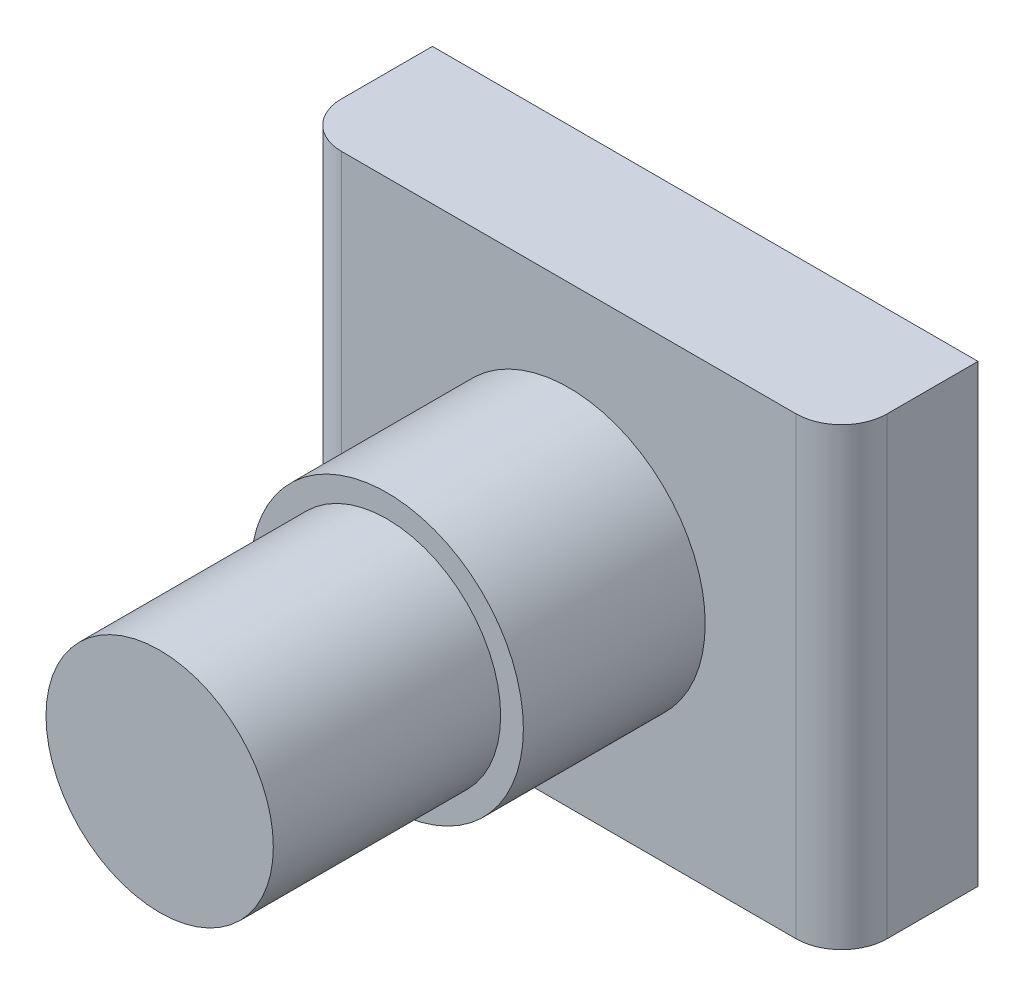
ISO-10303-21;
HEADER;
FILE_DESCRIPTION(('STEP AP214'),'2;1');
FILE_NAME('part.step','',(''),(''),'','','');
FILE_SCHEMA(('AUTOMOTIVE_DESIGN { 1 0 10303 214 1 1 1 1 }'));
ENDSEC;
DATA;
#1=APPLICATION_CONTEXT('core data for automotive mechanical design processes');
#2=APPLICATION_PROTOCOL_DEFINITION('international standard','automotive_design',2000,#1);
#3=PRODUCT_CONTEXT('',#1,'mechanical');
#4=PRODUCT('Part','Part','',(#3));
#5=PRODUCT_RELATED_PRODUCT_CATEGORY('part','',(#4));
#6=PRODUCT_DEFINITION_FORMATION('','',#4);
#7=PRODUCT_DEFINITION_CONTEXT('part definition',#1,'design');
#8=PRODUCT_DEFINITION('design','',#6,#7);
#9=PRODUCT_DEFINITION_SHAPE('','',#8);
#10=(LENGTH_UNIT() NAMED_UNIT(*) SI_UNIT(.MILLI.,.METRE.));
#11=(NAMED_UNIT(*) PLANE_ANGLE_UNIT() SI_UNIT($,.RADIAN.));
#12=(NAMED_UNIT(*) SI_UNIT($,.STERADIAN.) SOLID_ANGLE_UNIT());
#13=UNCERTAINTY_MEASURE_WITH_UNIT(LENGTH_MEASURE(1.E-05),#10,'distance_accuracy_value','');
#14=(GEOMETRIC_REPRESENTATION_CONTEXT(3) GLOBAL_UNCERTAINTY_ASSIGNED_CONTEXT((#13)) GLOBAL_UNIT_ASSIGNED_CONTEXT((#10,
#11,#12)) REPRESENTATION_CONTEXT('',''));
#15=CARTESIAN_POINT('',(0.,0.,0.));
#16=DIRECTION('',(0.,0.,1.));
#17=DIRECTION('',(1.,0.,0.));
#18=AXIS2_PLACEMENT_3D('',#15,#16,#17);
#19=CARTESIAN_POINT('',(6.,5.,3.));
#20=DIRECTION('',(-1.,0.,0.));
#21=DIRECTION('',(0.,-1.,0.));
#22=AXIS2_PLACEMENT_3D('',#19,#20,#21);
#23=PLANE('',#22);
#24=DIRECTION('',(0.,0.,-1.));
#25=VECTOR('',#24,1.);
#26=CARTESIAN_POINT('',(6.,5.,3.));
#27=LINE('',#26,#25);
#28=CARTESIAN_POINT('',(6.,5.,2.));
#29=VERTEX_POINT('',#28);
#30=CARTESIAN_POINT('',(6.,5.,0.));
#31=VERTEX_POINT('',#30);
#32=EDGE_CURVE('E84',#29,#31,#27,.T.);
#33=ORIENTED_EDGE('',*,*,#32,.F.);
#34=DIRECTION('',(0.,1.,0.));
#35=VECTOR('',#34,1.);
#36=CARTESIAN_POINT('',(6.,-5.,2.));
#37=LINE('',#36,#35);
#38=CARTESIAN_POINT('',(6.,-5.,2.));
#39=VERTEX_POINT('',#38);
#40=EDGE_CURVE('E55',#29,#39,#37,.F.);
#41=ORIENTED_EDGE('',*,*,#40,.T.);
#42=DIRECTION('',(0.,0.,-1.));
#43=VECTOR('',#42,1.);
#44=CARTESIAN_POINT('',(6.,-5.,3.));
#45=LINE('',#44,#43);
#46=CARTESIAN_POINT('',(6.,-5.,0.));
#47=VERTEX_POINT('',#46);
#48=EDGE_CURVE('E104',#39,#47,#45,.T.);
#49=ORIENTED_EDGE('',*,*,#48,.T.);
#50=DIRECTION('',(0.,1.,0.));
#51=VECTOR('',#50,1.);
#52=CARTESIAN_POINT('',(6.,5.,0.));
#53=LINE('',#52,#51);
#54=EDGE_CURVE('E100',#47,#31,#53,.T.);
#55=ORIENTED_EDGE('',*,*,#54,.T.);
#56=EDGE_LOOP('',(#33,#41,#49,#55));
#57=FACE_BOUND('',#56,.T.);
#58=ADVANCED_FACE('F32',(#57),#23,.F.);
#59=CARTESIAN_POINT('',(-6.,5.,3.));
#60=DIRECTION('',(0.,-1.,0.));
#61=DIRECTION('',(0.,0.,-1.));
#62=AXIS2_PLACEMENT_3D('',#59,#60,#61);
#63=PLANE('',#62);
#64=DIRECTION('',(-1.,0.,0.));
#65=VECTOR('',#64,1.);
#66=CARTESIAN_POINT('',(-6.,5.,3.));
#67=LINE('',#66,#65);
#68=CARTESIAN_POINT('',(5.,5.,3.));
#69=VERTEX_POINT('',#68);
#70=CARTESIAN_POINT('',(-5.,5.,3.));
#71=VERTEX_POINT('',#70);
#72=EDGE_CURVE('E118',#69,#71,#67,.T.);
#73=ORIENTED_EDGE('',*,*,#72,.F.);
#74=CARTESIAN_POINT('',(5.,5.,2.));
#75=DIRECTION('',(0.,-1.,0.));
#76=DIRECTION('',(0.,0.,-1.));
#77=AXIS2_PLACEMENT_3D('',#74,#75,#76);
#78=CIRCLE('',#77,1.);
#79=EDGE_CURVE('E91',#69,#29,#78,.F.);
#80=ORIENTED_EDGE('',*,*,#79,.T.);
#81=ORIENTED_EDGE('',*,*,#32,.T.);
#82=DIRECTION('',(-1.,0.,0.));
#83=VECTOR('',#82,1.);
#84=CARTESIAN_POINT('',(-6.,5.,0.));
#85=LINE('',#84,#83);
#86=CARTESIAN_POINT('',(-6.,5.,0.));
#87=VERTEX_POINT('',#86);
#88=EDGE_CURVE('E89',#31,#87,#85,.T.);
#89=ORIENTED_EDGE('',*,*,#88,.T.);
#90=DIRECTION('',(0.,0.,-1.));
#91=VECTOR('',#90,1.);
#92=CARTESIAN_POINT('',(-6.,5.,3.));
#93=LINE('',#92,#91);
#94=CARTESIAN_POINT('',(-6.,5.,2.));
#95=VERTEX_POINT('',#94);
#96=EDGE_CURVE('E94',#95,#87,#93,.T.);
#97=ORIENTED_EDGE('',*,*,#96,.F.);
#98=CARTESIAN_POINT('',(-5.,5.,2.));
#99=DIRECTION('',(0.,-1.,0.));
#100=DIRECTION('',(0.,0.,-1.));
#101=AXIS2_PLACEMENT_3D('',#98,#99,#100);
#102=CIRCLE('',#101,1.);
#103=EDGE_CURVE('E128',#95,#71,#102,.F.);
#104=ORIENTED_EDGE('',*,*,#103,.T.);
#105=EDGE_LOOP('',(#73,#80,#81,#89,#97,#104));
#106=FACE_BOUND('',#105,.T.);
#107=ADVANCED_FACE('F87',(#106),#63,.F.);
#108=CARTESIAN_POINT('',(-6.,5.,3.));
#109=DIRECTION('',(1.,0.,0.));
#110=DIRECTION('',(0.,1.,0.));
#111=AXIS2_PLACEMENT_3D('',#108,#109,#110);
#112=PLANE('',#111);
#113=DIRECTION('',(0.,0.,-1.));
#114=VECTOR('',#113,1.);
#115=CARTESIAN_POINT('',(-6.,-5.,3.));
#116=LINE('',#115,#114);
#117=CARTESIAN_POINT('',(-6.,-5.,2.));
#118=VERTEX_POINT('',#117);
#119=CARTESIAN_POINT('',(-6.,-5.,0.));
#120=VERTEX_POINT('',#119);
#121=EDGE_CURVE('E120',#118,#120,#116,.T.);
#122=ORIENTED_EDGE('',*,*,#121,.F.);
#123=DIRECTION('',(0.,-1.,0.));
#124=VECTOR('',#123,1.);
#125=CARTESIAN_POINT('',(-6.,5.,2.));
#126=LINE('',#125,#124);
#127=EDGE_CURVE('E11',#118,#95,#126,.F.);
#128=ORIENTED_EDGE('',*,*,#127,.T.);
#129=ORIENTED_EDGE('',*,*,#96,.T.);
#130=DIRECTION('',(0.,-1.,0.));
#131=VECTOR('',#130,1.);
#132=CARTESIAN_POINT('',(-6.,5.,0.));
#133=LINE('',#132,#131);
#134=EDGE_CURVE('E102',#87,#120,#133,.T.);
#135=ORIENTED_EDGE('',*,*,#134,.T.);
#136=EDGE_LOOP('',(#122,#128,#129,#135));
#137=FACE_BOUND('',#136,.T.);
#138=ADVANCED_FACE('F157',(#137),#112,.F.);
#139=CARTESIAN_POINT('',(-6.,-5.,3.));
#140=DIRECTION('',(0.,1.,0.));
#141=DIRECTION('',(0.,0.,1.));
#142=AXIS2_PLACEMENT_3D('',#139,#140,#141);
#143=PLANE('',#142);
#144=ORIENTED_EDGE('',*,*,#48,.F.);
#145=CARTESIAN_POINT('',(5.,-5.,2.));
#146=DIRECTION('',(0.,1.,0.));
#147=DIRECTION('',(0.,0.,1.));
#148=AXIS2_PLACEMENT_3D('',#145,#146,#147);
#149=CIRCLE('',#148,1.);
#150=CARTESIAN_POINT('',(5.,-5.,3.));
#151=VERTEX_POINT('',#150);
#152=EDGE_CURVE('E40',#39,#151,#149,.F.);
#153=ORIENTED_EDGE('',*,*,#152,.T.);
#154=DIRECTION('',(1.,0.,0.));
#155=VECTOR('',#154,1.);
#156=CARTESIAN_POINT('',(-6.,-5.,3.));
#157=LINE('',#156,#155);
#158=CARTESIAN_POINT('',(-5.,-5.,3.));
#159=VERTEX_POINT('',#158);
#160=EDGE_CURVE('E112',#159,#151,#157,.T.);
#161=ORIENTED_EDGE('',*,*,#160,.F.);
#162=CARTESIAN_POINT('',(-5.,-5.,2.));
#163=DIRECTION('',(0.,1.,0.));
#164=DIRECTION('',(0.,0.,1.));
#165=AXIS2_PLACEMENT_3D('',#162,#163,#164);
#166=CIRCLE('',#165,1.);
#167=EDGE_CURVE('E47',#159,#118,#166,.F.);
#168=ORIENTED_EDGE('',*,*,#167,.T.);
#169=ORIENTED_EDGE('',*,*,#121,.T.);
#170=DIRECTION('',(1.,0.,0.));
#171=VECTOR('',#170,1.);
#172=CARTESIAN_POINT('',(-6.,-5.,0.));
#173=LINE('',#172,#171);
#174=EDGE_CURVE('E116',#120,#47,#173,.T.);
#175=ORIENTED_EDGE('',*,*,#174,.T.);
#176=EDGE_LOOP('',(#144,#153,#161,#168,#169,#175));
#177=FACE_BOUND('',#176,.T.);
#178=ADVANCED_FACE('F134',(#177),#143,.F.);
#179=CARTESIAN_POINT('',(0.,0.,3.));
#180=DIRECTION('',(0.,0.,1.));
#181=DIRECTION('',(1.,0.,0.));
#182=AXIS2_PLACEMENT_3D('',#179,#180,#181);
#183=PLANE('',#182);
#184=CARTESIAN_POINT('',(0.,0.,3.));
#185=DIRECTION('',(0.,0.,1.));
#186=DIRECTION('',(1.,0.,0.));
#187=AXIS2_PLACEMENT_3D('',#184,#185,#186);
#188=CIRCLE('',#187,3.);
#189=CARTESIAN_POINT('',(3.,0.,3.));
#190=VERTEX_POINT('',#189);
#191=EDGE_CURVE('E106',#190,#190,#188,.T.);
#192=ORIENTED_EDGE('',*,*,#191,.F.);
#193=EDGE_LOOP('',(#192));
#194=FACE_BOUND('',#193,.T.);
#195=ORIENTED_EDGE('',*,*,#160,.T.);
#196=DIRECTION('',(0.,1.,0.));
#197=VECTOR('',#196,1.);
#198=CARTESIAN_POINT('',(5.,5.,3.));
#199=LINE('',#198,#197);
#200=EDGE_CURVE('E125',#151,#69,#199,.T.);
#201=ORIENTED_EDGE('',*,*,#200,.T.);
#202=ORIENTED_EDGE('',*,*,#72,.T.);
#203=DIRECTION('',(0.,-1.,0.));
#204=VECTOR('',#203,1.);
#205=CARTESIAN_POINT('',(-5.,-5.,3.));
#206=LINE('',#205,#204);
#207=EDGE_CURVE('E93',#71,#159,#206,.T.);
#208=ORIENTED_EDGE('',*,*,#207,.T.);
#209=EDGE_LOOP('',(#195,#201,#202,#208));
#210=FACE_BOUND('',#209,.T.);
#211=ADVANCED_FACE('F138',(#194,#210),#183,.T.);
#212=CARTESIAN_POINT('',(0.,0.,0.));
#213=DIRECTION('',(0.,0.,1.));
#214=DIRECTION('',(1.,0.,0.));
#215=AXIS2_PLACEMENT_3D('',#212,#213,#214);
#216=PLANE('',#215);
#217=ORIENTED_EDGE('',*,*,#54,.F.);
#218=ORIENTED_EDGE('',*,*,#174,.F.);
#219=ORIENTED_EDGE('',*,*,#134,.F.);
#220=ORIENTED_EDGE('',*,*,#88,.F.);
#221=EDGE_LOOP('',(#217,#218,#219,#220));
#222=FACE_BOUND('',#221,.T.);
#223=ADVANCED_FACE('F98',(#222),#216,.F.);
#224=CARTESIAN_POINT('',(0.,0.,12.));
#225=DIRECTION('',(0.,0.,1.));
#226=DIRECTION('',(1.,0.,0.));
#227=AXIS2_PLACEMENT_3D('',#224,#225,#226);
#228=CYLINDRICAL_SURFACE('',#227,3.);
#229=CARTESIAN_POINT('',(0.,0.,7.));
#230=DIRECTION('',(0.,0.,1.));
#231=DIRECTION('',(1.,0.,0.));
#232=AXIS2_PLACEMENT_3D('',#229,#230,#231);
#233=CIRCLE('',#232,3.);
#234=CARTESIAN_POINT('',(3.,0.,7.));
#235=VERTEX_POINT('',#234);
#236=EDGE_CURVE('E109',#235,#235,#233,.T.);
#237=ORIENTED_EDGE('',*,*,#236,.F.);
#238=EDGE_LOOP('',(#237));
#239=FACE_BOUND('',#238,.T.);
#240=ORIENTED_EDGE('',*,*,#191,.T.);
#241=EDGE_LOOP('',(#240));
#242=FACE_BOUND('',#241,.T.);
#243=ADVANCED_FACE('F167',(#239,#242),#228,.T.);
#244=CARTESIAN_POINT('',(0.,3.,7.));
#245=DIRECTION('',(0.,0.,-1.));
#246=DIRECTION('',(-1.,0.,0.));
#247=AXIS2_PLACEMENT_3D('',#244,#245,#246);
#248=PLANE('',#247);
#249=CARTESIAN_POINT('',(0.,0.,7.));
#250=DIRECTION('',(0.,0.,1.));
#251=DIRECTION('',(1.,0.,0.));
#252=AXIS2_PLACEMENT_3D('',#249,#250,#251);
#253=CIRCLE('',#252,2.5);
#254=CARTESIAN_POINT('',(2.5,0.,7.));
#255=VERTEX_POINT('',#254);
#256=EDGE_CURVE('E188',#255,#255,#253,.T.);
#257=ORIENTED_EDGE('',*,*,#256,.F.);
#258=EDGE_LOOP('',(#257));
#259=FACE_BOUND('',#258,.T.);
#260=ORIENTED_EDGE('',*,*,#236,.T.);
#261=EDGE_LOOP('',(#260));
#262=FACE_BOUND('',#261,.T.);
#263=ADVANCED_FACE('F173',(#259,#262),#248,.F.);
#264=CARTESIAN_POINT('',(0.,0.,12.));
#265=DIRECTION('',(0.,0.,1.));
#266=DIRECTION('',(1.,0.,0.));
#267=AXIS2_PLACEMENT_3D('',#264,#265,#266);
#268=CYLINDRICAL_SURFACE('',#267,2.5);
#269=CARTESIAN_POINT('',(0.,0.,12.));
#270=DIRECTION('',(0.,0.,1.));
#271=DIRECTION('',(1.,0.,0.));
#272=AXIS2_PLACEMENT_3D('',#269,#270,#271);
#273=CIRCLE('',#272,2.5);
#274=CARTESIAN_POINT('',(2.5,0.,12.));
#275=VERTEX_POINT('',#274);
#276=EDGE_CURVE('E185',#275,#275,#273,.T.);
#277=ORIENTED_EDGE('',*,*,#276,.F.);
#278=EDGE_LOOP('',(#277));
#279=FACE_BOUND('',#278,.T.);
#280=ORIENTED_EDGE('',*,*,#256,.T.);
#281=EDGE_LOOP('',(#280));
#282=FACE_BOUND('',#281,.T.);
#283=ADVANCED_FACE('F149',(#279,#282),#268,.T.);
#284=CARTESIAN_POINT('',(0.,2.5,12.));
#285=DIRECTION('',(0.,0.,-1.));
#286=DIRECTION('',(-1.,0.,0.));
#287=AXIS2_PLACEMENT_3D('',#284,#285,#286);
#288=PLANE('',#287);
#289=ORIENTED_EDGE('',*,*,#276,.T.);
#290=EDGE_LOOP('',(#289));
#291=FACE_BOUND('',#290,.T.);
#292=ADVANCED_FACE('F143',(#291),#288,.F.);
#293=CARTESIAN_POINT('',(5.,0.,2.));
#294=DIRECTION('',(0.,-1.,0.));
#295=DIRECTION('',(1.,0.,0.));
#296=AXIS2_PLACEMENT_3D('',#293,#294,#295);
#297=CYLINDRICAL_SURFACE('',#296,1.);
#298=ORIENTED_EDGE('',*,*,#152,.F.);
#299=ORIENTED_EDGE('',*,*,#40,.F.);
#300=ORIENTED_EDGE('',*,*,#79,.F.);
#301=ORIENTED_EDGE('',*,*,#200,.F.);
#302=EDGE_LOOP('',(#298,#299,#300,#301));
#303=FACE_BOUND('',#302,.T.);
#304=ADVANCED_FACE('F141',(#303),#297,.T.);
#305=CARTESIAN_POINT('',(-5.,0.,2.));
#306=DIRECTION('',(0.,1.,0.));
#307=DIRECTION('',(-1.,0.,0.));
#308=AXIS2_PLACEMENT_3D('',#305,#306,#307);
#309=CYLINDRICAL_SURFACE('',#308,1.);
#310=ORIENTED_EDGE('',*,*,#103,.F.);
#311=ORIENTED_EDGE('',*,*,#127,.F.);
#312=ORIENTED_EDGE('',*,*,#167,.F.);
#313=ORIENTED_EDGE('',*,*,#207,.F.);
#314=EDGE_LOOP('',(#310,#311,#312,#313));
#315=FACE_BOUND('',#314,.T.);
#316=ADVANCED_FACE('F34',(#315),#309,.T.);
#317=CLOSED_SHELL('',(#58,#107,#138,#178,#211,#223,#243,#263,#283,#292,#304,#316));
#318=MANIFOLD_SOLID_BREP('B2',#317);
#319=ADVANCED_BREP_SHAPE_REPRESENTATION('',(#18,#318),#14);
#320=SHAPE_DEFINITION_REPRESENTATION(#9,#319);
ENDSEC;
END-ISO-10303-21;
